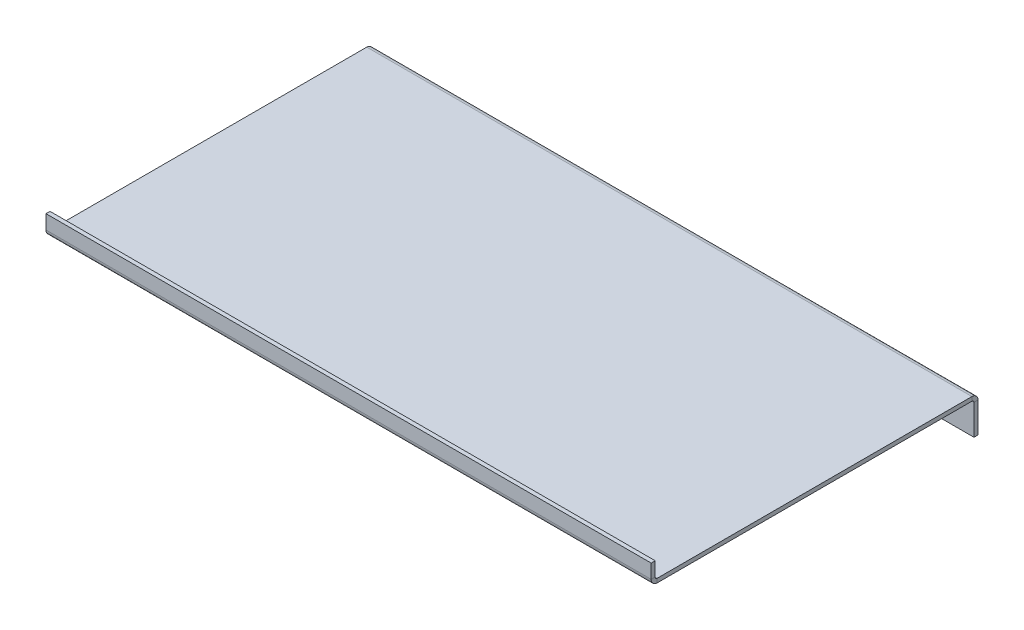
ISO-10303-21;
HEADER;
FILE_DESCRIPTION(('STEP AP214'),'2;1');
FILE_NAME('part.step','',(''),(''),'','','');
FILE_SCHEMA(('AUTOMOTIVE_DESIGN { 1 0 10303 214 1 1 1 1 }'));
ENDSEC;
DATA;
#1=APPLICATION_CONTEXT('core data for automotive mechanical design processes');
#2=APPLICATION_PROTOCOL_DEFINITION('international standard','automotive_design',2000,#1);
#3=PRODUCT_CONTEXT('',#1,'mechanical');
#4=PRODUCT('Part','Part','',(#3));
#5=PRODUCT_RELATED_PRODUCT_CATEGORY('part','',(#4));
#6=PRODUCT_DEFINITION_FORMATION('','',#4);
#7=PRODUCT_DEFINITION_CONTEXT('part definition',#1,'design');
#8=PRODUCT_DEFINITION('design','',#6,#7);
#9=PRODUCT_DEFINITION_SHAPE('','',#8);
#10=(LENGTH_UNIT() NAMED_UNIT(*) SI_UNIT(.MILLI.,.METRE.));
#11=(NAMED_UNIT(*) PLANE_ANGLE_UNIT() SI_UNIT($,.RADIAN.));
#12=(NAMED_UNIT(*) SI_UNIT($,.STERADIAN.) SOLID_ANGLE_UNIT());
#13=UNCERTAINTY_MEASURE_WITH_UNIT(LENGTH_MEASURE(1.E-05),#10,'distance_accuracy_value','');
#14=(GEOMETRIC_REPRESENTATION_CONTEXT(3) GLOBAL_UNCERTAINTY_ASSIGNED_CONTEXT((#13)) GLOBAL_UNIT_ASSIGNED_CONTEXT((#10,
#11,#12)) REPRESENTATION_CONTEXT('',''));
#15=CARTESIAN_POINT('',(0.,0.,0.));
#16=DIRECTION('',(0.,0.,1.));
#17=DIRECTION('',(1.,0.,0.));
#18=AXIS2_PLACEMENT_3D('',#15,#16,#17);
#19=CARTESIAN_POINT('',(150.,8.,0.5));
#20=DIRECTION('',(1.,0.,0.));
#21=DIRECTION('',(0.,0.,-1.));
#22=AXIS2_PLACEMENT_3D('',#19,#20,#21);
#23=PLANE('',#22);
#24=DIRECTION('',(0.,1.,0.));
#25=VECTOR('',#24,1.);
#26=CARTESIAN_POINT('',(150.,8.,0.5));
#27=LINE('',#26,#25);
#28=CARTESIAN_POINT('',(150.,8.,0.5));
#29=VERTEX_POINT('',#28);
#30=CARTESIAN_POINT('',(150.,9.,0.5));
#31=VERTEX_POINT('',#30);
#32=EDGE_CURVE('E11',#29,#31,#27,.T.);
#33=ORIENTED_EDGE('',*,*,#32,.F.);
#34=CARTESIAN_POINT('',(150.,7.5,0.5));
#35=DIRECTION('',(-1.,0.,0.));
#36=DIRECTION('',(0.,0.,1.));
#37=AXIS2_PLACEMENT_3D('',#34,#35,#36);
#38=CIRCLE('',#37,0.5);
#39=CARTESIAN_POINT('',(150.,7.5,0.));
#40=VERTEX_POINT('',#39);
#41=EDGE_CURVE('E245',#40,#29,#38,.F.);
#42=ORIENTED_EDGE('',*,*,#41,.F.);
#43=DIRECTION('',(0.,0.,1.));
#44=VECTOR('',#43,1.);
#45=CARTESIAN_POINT('',(150.,7.5,-1.));
#46=LINE('',#45,#44);
#47=CARTESIAN_POINT('',(150.,7.5,-1.));
#48=VERTEX_POINT('',#47);
#49=EDGE_CURVE('E43',#48,#40,#46,.T.);
#50=ORIENTED_EDGE('',*,*,#49,.F.);
#51=CARTESIAN_POINT('',(150.,7.5,0.5));
#52=DIRECTION('',(1.,0.,0.));
#53=DIRECTION('',(0.,0.,-1.));
#54=AXIS2_PLACEMENT_3D('',#51,#52,#53);
#55=CIRCLE('',#54,1.5);
#56=EDGE_CURVE('E144',#48,#31,#55,.T.);
#57=ORIENTED_EDGE('',*,*,#56,.T.);
#58=EDGE_LOOP('',(#33,#42,#50,#57));
#59=FACE_BOUND('',#58,.T.);
#60=ADVANCED_FACE('F35',(#59),#23,.T.);
#61=CARTESIAN_POINT('',(150.,7.5,-1.));
#62=DIRECTION('',(1.,0.,0.));
#63=DIRECTION('',(0.,0.,-1.));
#64=AXIS2_PLACEMENT_3D('',#61,#62,#63);
#65=PLANE('',#64);
#66=DIRECTION('',(0.,0.,1.));
#67=VECTOR('',#66,1.);
#68=CARTESIAN_POINT('',(150.,8.,0.));
#69=LINE('',#68,#67);
#70=CARTESIAN_POINT('',(150.,7.99999999999999,78.5));
#71=VERTEX_POINT('',#70);
#72=EDGE_CURVE('E138',#29,#71,#69,.T.);
#73=ORIENTED_EDGE('',*,*,#72,.F.);
#74=ORIENTED_EDGE('',*,*,#32,.T.);
#75=DIRECTION('',(0.,0.,1.));
#76=VECTOR('',#75,1.);
#77=CARTESIAN_POINT('',(150.,9.,0.));
#78=LINE('',#77,#76);
#79=CARTESIAN_POINT('',(150.,8.99999999999999,78.5));
#80=VERTEX_POINT('',#79);
#81=EDGE_CURVE('E135',#31,#80,#78,.T.);
#82=ORIENTED_EDGE('',*,*,#81,.T.);
#83=DIRECTION('',(0.,-1.,0.));
#84=VECTOR('',#83,1.);
#85=CARTESIAN_POINT('',(150.,8.99999999999999,78.5));
#86=LINE('',#85,#84);
#87=EDGE_CURVE('E226',#80,#71,#86,.T.);
#88=ORIENTED_EDGE('',*,*,#87,.T.);
#89=EDGE_LOOP('',(#73,#74,#82,#88));
#90=FACE_BOUND('',#89,.T.);
#91=ADVANCED_FACE('F133',(#90),#65,.T.);
#92=CARTESIAN_POINT('',(0.,7.5,0.));
#93=DIRECTION('',(-1.,0.,0.));
#94=DIRECTION('',(0.,0.,1.));
#95=AXIS2_PLACEMENT_3D('',#92,#93,#94);
#96=PLANE('',#95);
#97=DIRECTION('',(0.,0.,-1.));
#98=VECTOR('',#97,1.);
#99=CARTESIAN_POINT('',(0.,7.5,0.));
#100=LINE('',#99,#98);
#101=CARTESIAN_POINT('',(0.,7.5,0.));
#102=VERTEX_POINT('',#101);
#103=CARTESIAN_POINT('',(0.,7.5,-1.));
#104=VERTEX_POINT('',#103);
#105=EDGE_CURVE('E231',#102,#104,#100,.T.);
#106=ORIENTED_EDGE('',*,*,#105,.F.);
#107=CARTESIAN_POINT('',(0.,7.5,0.5));
#108=DIRECTION('',(-1.,0.,0.));
#109=DIRECTION('',(0.,0.,1.));
#110=AXIS2_PLACEMENT_3D('',#107,#108,#109);
#111=CIRCLE('',#110,0.5);
#112=CARTESIAN_POINT('',(0.,8.,0.5));
#113=VERTEX_POINT('',#112);
#114=EDGE_CURVE('E183',#102,#113,#111,.F.);
#115=ORIENTED_EDGE('',*,*,#114,.T.);
#116=DIRECTION('',(0.,-1.,0.));
#117=VECTOR('',#116,1.);
#118=CARTESIAN_POINT('',(0.,9.,0.5));
#119=LINE('',#118,#117);
#120=CARTESIAN_POINT('',(0.,9.,0.5));
#121=VERTEX_POINT('',#120);
#122=EDGE_CURVE('E229',#121,#113,#119,.T.);
#123=ORIENTED_EDGE('',*,*,#122,.F.);
#124=CARTESIAN_POINT('',(0.,7.5,0.5));
#125=DIRECTION('',(1.,0.,0.));
#126=DIRECTION('',(0.,0.,-1.));
#127=AXIS2_PLACEMENT_3D('',#124,#125,#126);
#128=CIRCLE('',#127,1.5);
#129=EDGE_CURVE('E156',#104,#121,#128,.T.);
#130=ORIENTED_EDGE('',*,*,#129,.F.);
#131=EDGE_LOOP('',(#106,#115,#123,#130));
#132=FACE_BOUND('',#131,.T.);
#133=ADVANCED_FACE('F283',(#132),#96,.T.);
#134=CARTESIAN_POINT('',(0.,9.,0.5));
#135=DIRECTION('',(-1.,0.,0.));
#136=DIRECTION('',(0.,0.,1.));
#137=AXIS2_PLACEMENT_3D('',#134,#135,#136);
#138=PLANE('',#137);
#139=DIRECTION('',(0.,1.,0.));
#140=VECTOR('',#139,1.);
#141=CARTESIAN_POINT('',(0.,0.,0.));
#142=LINE('',#141,#140);
#143=CARTESIAN_POINT('',(0.,0.,0.));
#144=VERTEX_POINT('',#143);
#145=EDGE_CURVE('E186',#144,#102,#142,.T.);
#146=ORIENTED_EDGE('',*,*,#145,.T.);
#147=ORIENTED_EDGE('',*,*,#105,.T.);
#148=DIRECTION('',(0.,1.,0.));
#149=VECTOR('',#148,1.);
#150=CARTESIAN_POINT('',(0.,0.,-1.));
#151=LINE('',#150,#149);
#152=CARTESIAN_POINT('',(0.,0.,-1.));
#153=VERTEX_POINT('',#152);
#154=EDGE_CURVE('E192',#153,#104,#151,.T.);
#155=ORIENTED_EDGE('',*,*,#154,.F.);
#156=DIRECTION('',(0.,0.,1.));
#157=VECTOR('',#156,1.);
#158=CARTESIAN_POINT('',(0.,0.,-1.));
#159=LINE('',#158,#157);
#160=EDGE_CURVE('E189',#153,#144,#159,.T.);
#161=ORIENTED_EDGE('',*,*,#160,.T.);
#162=EDGE_LOOP('',(#146,#147,#155,#161));
#163=FACE_BOUND('',#162,.T.);
#164=ADVANCED_FACE('F286',(#163),#138,.T.);
#165=CARTESIAN_POINT('',(150.,9.49999999999999,80.));
#166=DIRECTION('',(1.,0.,0.));
#167=DIRECTION('',(0.,0.,-1.));
#168=AXIS2_PLACEMENT_3D('',#165,#166,#167);
#169=PLANE('',#168);
#170=DIRECTION('',(0.,0.,-1.));
#171=VECTOR('',#170,1.);
#172=CARTESIAN_POINT('',(150.,9.49999999999999,80.));
#173=LINE('',#172,#171);
#174=CARTESIAN_POINT('',(150.,9.49999999999999,80.));
#175=VERTEX_POINT('',#174);
#176=CARTESIAN_POINT('',(150.,9.49999999999999,79.));
#177=VERTEX_POINT('',#176);
#178=EDGE_CURVE('E51',#175,#177,#173,.T.);
#179=ORIENTED_EDGE('',*,*,#178,.F.);
#180=CARTESIAN_POINT('',(150.,9.49999999999999,78.5));
#181=DIRECTION('',(1.,0.,0.));
#182=DIRECTION('',(0.,0.,-1.));
#183=AXIS2_PLACEMENT_3D('',#180,#181,#182);
#184=CIRCLE('',#183,1.5);
#185=EDGE_CURVE('E255',#71,#175,#184,.F.);
#186=ORIENTED_EDGE('',*,*,#185,.F.);
#187=ORIENTED_EDGE('',*,*,#87,.F.);
#188=CARTESIAN_POINT('',(150.,9.49999999999999,78.5));
#189=DIRECTION('',(1.,0.,0.));
#190=DIRECTION('',(0.,0.,-1.));
#191=AXIS2_PLACEMENT_3D('',#188,#189,#190);
#192=CIRCLE('',#191,0.5);
#193=EDGE_CURVE('E164',#80,#177,#192,.F.);
#194=ORIENTED_EDGE('',*,*,#193,.T.);
#195=EDGE_LOOP('',(#179,#186,#187,#194));
#196=FACE_BOUND('',#195,.T.);
#197=ADVANCED_FACE('F278',(#196),#169,.T.);
#198=CARTESIAN_POINT('',(150.,8.99999999999999,78.5));
#199=DIRECTION('',(1.,0.,0.));
#200=DIRECTION('',(0.,0.,-1.));
#201=AXIS2_PLACEMENT_3D('',#198,#199,#200);
#202=PLANE('',#201);
#203=DIRECTION('',(0.,1.,0.));
#204=VECTOR('',#203,1.);
#205=CARTESIAN_POINT('',(150.,7.99999999999999,80.));
#206=LINE('',#205,#204);
#207=CARTESIAN_POINT('',(150.,13.,80.));
#208=VERTEX_POINT('',#207);
#209=EDGE_CURVE('E258',#175,#208,#206,.T.);
#210=ORIENTED_EDGE('',*,*,#209,.F.);
#211=ORIENTED_EDGE('',*,*,#178,.T.);
#212=DIRECTION('',(0.,1.,0.));
#213=VECTOR('',#212,1.);
#214=CARTESIAN_POINT('',(150.,7.99999999999999,79.));
#215=LINE('',#214,#213);
#216=CARTESIAN_POINT('',(150.,13.,79.));
#217=VERTEX_POINT('',#216);
#218=EDGE_CURVE('E105',#177,#217,#215,.T.);
#219=ORIENTED_EDGE('',*,*,#218,.T.);
#220=DIRECTION('',(0.,0.,-1.));
#221=VECTOR('',#220,1.);
#222=CARTESIAN_POINT('',(150.,13.,80.));
#223=LINE('',#222,#221);
#224=EDGE_CURVE('E261',#208,#217,#223,.T.);
#225=ORIENTED_EDGE('',*,*,#224,.F.);
#226=EDGE_LOOP('',(#210,#211,#219,#225));
#227=FACE_BOUND('',#226,.T.);
#228=ADVANCED_FACE('F267',(#227),#202,.T.);
#229=CARTESIAN_POINT('',(0.,7.99999999999999,78.5));
#230=DIRECTION('',(-1.,0.,0.));
#231=DIRECTION('',(0.,0.,1.));
#232=AXIS2_PLACEMENT_3D('',#229,#230,#231);
#233=PLANE('',#232);
#234=DIRECTION('',(0.,1.,0.));
#235=VECTOR('',#234,1.);
#236=CARTESIAN_POINT('',(0.,7.99999999999999,78.5));
#237=LINE('',#236,#235);
#238=CARTESIAN_POINT('',(0.,7.99999999999999,78.5));
#239=VERTEX_POINT('',#238);
#240=CARTESIAN_POINT('',(0.,8.99999999999999,78.5));
#241=VERTEX_POINT('',#240);
#242=EDGE_CURVE('E92',#239,#241,#237,.T.);
#243=ORIENTED_EDGE('',*,*,#242,.F.);
#244=CARTESIAN_POINT('',(0.,9.49999999999999,78.5));
#245=DIRECTION('',(1.,0.,0.));
#246=DIRECTION('',(0.,0.,-1.));
#247=AXIS2_PLACEMENT_3D('',#244,#245,#246);
#248=CIRCLE('',#247,1.5);
#249=CARTESIAN_POINT('',(0.,9.49999999999999,80.));
#250=VERTEX_POINT('',#249);
#251=EDGE_CURVE('E179',#239,#250,#248,.F.);
#252=ORIENTED_EDGE('',*,*,#251,.T.);
#253=DIRECTION('',(0.,0.,1.));
#254=VECTOR('',#253,1.);
#255=CARTESIAN_POINT('',(0.,9.49999999999999,79.));
#256=LINE('',#255,#254);
#257=CARTESIAN_POINT('',(0.,9.49999999999999,79.));
#258=VERTEX_POINT('',#257);
#259=EDGE_CURVE('E99',#258,#250,#256,.T.);
#260=ORIENTED_EDGE('',*,*,#259,.F.);
#261=CARTESIAN_POINT('',(0.,9.49999999999999,78.5));
#262=DIRECTION('',(1.,0.,0.));
#263=DIRECTION('',(0.,0.,-1.));
#264=AXIS2_PLACEMENT_3D('',#261,#262,#263);
#265=CIRCLE('',#264,0.5);
#266=EDGE_CURVE('E198',#241,#258,#265,.F.);
#267=ORIENTED_EDGE('',*,*,#266,.F.);
#268=EDGE_LOOP('',(#243,#252,#260,#267));
#269=FACE_BOUND('',#268,.T.);
#270=ADVANCED_FACE('F315',(#269),#233,.T.);
#271=CARTESIAN_POINT('',(0.,9.49999999999999,79.));
#272=DIRECTION('',(-1.,0.,0.));
#273=DIRECTION('',(0.,0.,1.));
#274=AXIS2_PLACEMENT_3D('',#271,#272,#273);
#275=PLANE('',#274);
#276=DIRECTION('',(0.,0.,1.));
#277=VECTOR('',#276,1.);
#278=CARTESIAN_POINT('',(0.,8.,0.));
#279=LINE('',#278,#277);
#280=EDGE_CURVE('E181',#113,#239,#279,.T.);
#281=ORIENTED_EDGE('',*,*,#280,.T.);
#282=ORIENTED_EDGE('',*,*,#242,.T.);
#283=DIRECTION('',(0.,0.,1.));
#284=VECTOR('',#283,1.);
#285=CARTESIAN_POINT('',(0.,9.,0.));
#286=LINE('',#285,#284);
#287=EDGE_CURVE('E196',#121,#241,#286,.T.);
#288=ORIENTED_EDGE('',*,*,#287,.F.);
#289=ORIENTED_EDGE('',*,*,#122,.T.);
#290=EDGE_LOOP('',(#281,#282,#288,#289));
#291=FACE_BOUND('',#290,.T.);
#292=ADVANCED_FACE('F318',(#291),#275,.T.);
#293=CARTESIAN_POINT('',(150.,7.99999999999999,79.));
#294=DIRECTION('',(0.,0.,1.));
#295=DIRECTION('',(1.,0.,0.));
#296=AXIS2_PLACEMENT_3D('',#293,#294,#295);
#297=PLANE('',#296);
#298=DIRECTION('',(0.,1.,0.));
#299=VECTOR('',#298,1.);
#300=CARTESIAN_POINT('',(0.,7.99999999999999,79.));
#301=LINE('',#300,#299);
#302=CARTESIAN_POINT('',(0.,13.,79.));
#303=VERTEX_POINT('',#302);
#304=EDGE_CURVE('E170',#258,#303,#301,.T.);
#305=ORIENTED_EDGE('',*,*,#304,.T.);
#306=DIRECTION('',(-1.,0.,0.));
#307=VECTOR('',#306,1.);
#308=CARTESIAN_POINT('',(150.,13.,79.));
#309=LINE('',#308,#307);
#310=EDGE_CURVE('E222',#217,#303,#309,.T.);
#311=ORIENTED_EDGE('',*,*,#310,.F.);
#312=ORIENTED_EDGE('',*,*,#218,.F.);
#313=DIRECTION('',(-1.,0.,0.));
#314=VECTOR('',#313,1.);
#315=CARTESIAN_POINT('',(150.,9.49999999999999,79.));
#316=LINE('',#315,#314);
#317=EDGE_CURVE('E166',#177,#258,#316,.T.);
#318=ORIENTED_EDGE('',*,*,#317,.T.);
#319=EDGE_LOOP('',(#305,#311,#312,#318));
#320=FACE_BOUND('',#319,.T.);
#321=ADVANCED_FACE('F321',(#320),#297,.F.);
#322=CARTESIAN_POINT('',(150.,13.,80.));
#323=DIRECTION('',(0.,1.,0.));
#324=DIRECTION('',(0.,0.,1.));
#325=AXIS2_PLACEMENT_3D('',#322,#323,#324);
#326=PLANE('',#325);
#327=DIRECTION('',(0.,0.,-1.));
#328=VECTOR('',#327,1.);
#329=CARTESIAN_POINT('',(0.,13.,80.));
#330=LINE('',#329,#328);
#331=CARTESIAN_POINT('',(0.,13.,80.));
#332=VERTEX_POINT('',#331);
#333=EDGE_CURVE('E173',#332,#303,#330,.T.);
#334=ORIENTED_EDGE('',*,*,#333,.F.);
#335=DIRECTION('',(-1.,0.,0.));
#336=VECTOR('',#335,1.);
#337=CARTESIAN_POINT('',(150.,13.,80.));
#338=LINE('',#337,#336);
#339=EDGE_CURVE('E220',#208,#332,#338,.T.);
#340=ORIENTED_EDGE('',*,*,#339,.F.);
#341=ORIENTED_EDGE('',*,*,#224,.T.);
#342=ORIENTED_EDGE('',*,*,#310,.T.);
#343=EDGE_LOOP('',(#334,#340,#341,#342));
#344=FACE_BOUND('',#343,.T.);
#345=ADVANCED_FACE('F266',(#344),#326,.T.);
#346=CARTESIAN_POINT('',(150.,7.99999999999999,80.));
#347=DIRECTION('',(0.,0.,1.));
#348=DIRECTION('',(1.,0.,0.));
#349=AXIS2_PLACEMENT_3D('',#346,#347,#348);
#350=PLANE('',#349);
#351=DIRECTION('',(0.,1.,0.));
#352=VECTOR('',#351,1.);
#353=CARTESIAN_POINT('',(0.,7.99999999999999,80.));
#354=LINE('',#353,#352);
#355=EDGE_CURVE('E176',#250,#332,#354,.T.);
#356=ORIENTED_EDGE('',*,*,#355,.F.);
#357=DIRECTION('',(-1.,0.,0.));
#358=VECTOR('',#357,1.);
#359=CARTESIAN_POINT('',(150.,9.49999999999999,80.));
#360=LINE('',#359,#358);
#361=EDGE_CURVE('E217',#175,#250,#360,.T.);
#362=ORIENTED_EDGE('',*,*,#361,.F.);
#363=ORIENTED_EDGE('',*,*,#209,.T.);
#364=ORIENTED_EDGE('',*,*,#339,.T.);
#365=EDGE_LOOP('',(#356,#362,#363,#364));
#366=FACE_BOUND('',#365,.T.);
#367=ADVANCED_FACE('F271',(#366),#350,.T.);
#368=CARTESIAN_POINT('',(150.,9.49999999999999,78.5));
#369=DIRECTION('',(-1.,0.,0.));
#370=DIRECTION('',(0.,0.,1.));
#371=AXIS2_PLACEMENT_3D('',#368,#369,#370);
#372=CYLINDRICAL_SURFACE('',#371,1.5);
#373=ORIENTED_EDGE('',*,*,#251,.F.);
#374=DIRECTION('',(-1.,0.,0.));
#375=VECTOR('',#374,1.);
#376=CARTESIAN_POINT('',(150.,7.99999999999999,78.5));
#377=LINE('',#376,#375);
#378=EDGE_CURVE('E214',#71,#239,#377,.T.);
#379=ORIENTED_EDGE('',*,*,#378,.F.);
#380=ORIENTED_EDGE('',*,*,#185,.T.);
#381=ORIENTED_EDGE('',*,*,#361,.T.);
#382=EDGE_LOOP('',(#373,#379,#380,#381));
#383=FACE_BOUND('',#382,.T.);
#384=ADVANCED_FACE('F274',(#383),#372,.T.);
#385=CARTESIAN_POINT('',(150.,8.,0.));
#386=DIRECTION('',(0.,-1.,0.));
#387=DIRECTION('',(0.,0.,-1.));
#388=AXIS2_PLACEMENT_3D('',#385,#386,#387);
#389=PLANE('',#388);
#390=ORIENTED_EDGE('',*,*,#280,.F.);
#391=DIRECTION('',(-1.,0.,0.));
#392=VECTOR('',#391,1.);
#393=CARTESIAN_POINT('',(150.,8.,0.5));
#394=LINE('',#393,#392);
#395=EDGE_CURVE('E211',#29,#113,#394,.T.);
#396=ORIENTED_EDGE('',*,*,#395,.F.);
#397=ORIENTED_EDGE('',*,*,#72,.T.);
#398=ORIENTED_EDGE('',*,*,#378,.T.);
#399=EDGE_LOOP('',(#390,#396,#397,#398));
#400=FACE_BOUND('',#399,.T.);
#401=ADVANCED_FACE('F281',(#400),#389,.T.);
#402=CARTESIAN_POINT('',(150.,7.5,0.5));
#403=DIRECTION('',(-1.,0.,0.));
#404=DIRECTION('',(0.,0.,1.));
#405=AXIS2_PLACEMENT_3D('',#402,#403,#404);
#406=CYLINDRICAL_SURFACE('',#405,0.5);
#407=ORIENTED_EDGE('',*,*,#114,.F.);
#408=DIRECTION('',(-1.,0.,0.));
#409=VECTOR('',#408,1.);
#410=CARTESIAN_POINT('',(150.,7.5,0.));
#411=LINE('',#410,#409);
#412=EDGE_CURVE('E208',#40,#102,#411,.T.);
#413=ORIENTED_EDGE('',*,*,#412,.F.);
#414=ORIENTED_EDGE('',*,*,#41,.T.);
#415=ORIENTED_EDGE('',*,*,#395,.T.);
#416=EDGE_LOOP('',(#407,#413,#414,#415));
#417=FACE_BOUND('',#416,.T.);
#418=ADVANCED_FACE('F244',(#417),#406,.F.);
#419=CARTESIAN_POINT('',(150.,0.,0.));
#420=DIRECTION('',(0.,0.,1.));
#421=DIRECTION('',(1.,0.,0.));
#422=AXIS2_PLACEMENT_3D('',#419,#420,#421);
#423=PLANE('',#422);
#424=ORIENTED_EDGE('',*,*,#145,.F.);
#425=DIRECTION('',(-1.,0.,0.));
#426=VECTOR('',#425,1.);
#427=CARTESIAN_POINT('',(150.,0.,0.));
#428=LINE('',#427,#426);
#429=CARTESIAN_POINT('',(150.,0.,0.));
#430=VERTEX_POINT('',#429);
#431=EDGE_CURVE('E206',#430,#144,#428,.T.);
#432=ORIENTED_EDGE('',*,*,#431,.F.);
#433=DIRECTION('',(0.,1.,0.));
#434=VECTOR('',#433,1.);
#435=CARTESIAN_POINT('',(150.,0.,0.));
#436=LINE('',#435,#434);
#437=EDGE_CURVE('E238',#430,#40,#436,.T.);
#438=ORIENTED_EDGE('',*,*,#437,.T.);
#439=ORIENTED_EDGE('',*,*,#412,.T.);
#440=EDGE_LOOP('',(#424,#432,#438,#439));
#441=FACE_BOUND('',#440,.T.);
#442=ADVANCED_FACE('F249',(#441),#423,.T.);
#443=CARTESIAN_POINT('',(150.,0.,-1.));
#444=DIRECTION('',(0.,-1.,0.));
#445=DIRECTION('',(0.,0.,-1.));
#446=AXIS2_PLACEMENT_3D('',#443,#444,#445);
#447=PLANE('',#446);
#448=ORIENTED_EDGE('',*,*,#160,.F.);
#449=DIRECTION('',(-1.,0.,0.));
#450=VECTOR('',#449,1.);
#451=CARTESIAN_POINT('',(150.,0.,-1.));
#452=LINE('',#451,#450);
#453=CARTESIAN_POINT('',(150.,0.,-1.));
#454=VERTEX_POINT('',#453);
#455=EDGE_CURVE('E204',#454,#153,#452,.T.);
#456=ORIENTED_EDGE('',*,*,#455,.F.);
#457=DIRECTION('',(0.,0.,1.));
#458=VECTOR('',#457,1.);
#459=CARTESIAN_POINT('',(150.,0.,-1.));
#460=LINE('',#459,#458);
#461=EDGE_CURVE('E250',#454,#430,#460,.T.);
#462=ORIENTED_EDGE('',*,*,#461,.T.);
#463=ORIENTED_EDGE('',*,*,#431,.T.);
#464=EDGE_LOOP('',(#448,#456,#462,#463));
#465=FACE_BOUND('',#464,.T.);
#466=ADVANCED_FACE('F291',(#465),#447,.T.);
#467=CARTESIAN_POINT('',(150.,0.,-1.));
#468=DIRECTION('',(0.,0.,1.));
#469=DIRECTION('',(1.,0.,0.));
#470=AXIS2_PLACEMENT_3D('',#467,#468,#469);
#471=PLANE('',#470);
#472=ORIENTED_EDGE('',*,*,#154,.T.);
#473=DIRECTION('',(-1.,0.,0.));
#474=VECTOR('',#473,1.);
#475=CARTESIAN_POINT('',(150.,7.5,-1.));
#476=LINE('',#475,#474);
#477=EDGE_CURVE('E158',#48,#104,#476,.T.);
#478=ORIENTED_EDGE('',*,*,#477,.F.);
#479=DIRECTION('',(0.,1.,0.));
#480=VECTOR('',#479,1.);
#481=CARTESIAN_POINT('',(150.,0.,-1.));
#482=LINE('',#481,#480);
#483=EDGE_CURVE('E149',#454,#48,#482,.T.);
#484=ORIENTED_EDGE('',*,*,#483,.F.);
#485=ORIENTED_EDGE('',*,*,#455,.T.);
#486=EDGE_LOOP('',(#472,#478,#484,#485));
#487=FACE_BOUND('',#486,.T.);
#488=ADVANCED_FACE('F289',(#487),#471,.F.);
#489=CARTESIAN_POINT('',(150.,7.5,0.5));
#490=DIRECTION('',(-1.,0.,0.));
#491=DIRECTION('',(0.,0.,1.));
#492=AXIS2_PLACEMENT_3D('',#489,#490,#491);
#493=CYLINDRICAL_SURFACE('',#492,1.5);
#494=ORIENTED_EDGE('',*,*,#129,.T.);
#495=DIRECTION('',(-1.,0.,0.));
#496=VECTOR('',#495,1.);
#497=CARTESIAN_POINT('',(150.,9.,0.5));
#498=LINE('',#497,#496);
#499=EDGE_CURVE('E153',#31,#121,#498,.T.);
#500=ORIENTED_EDGE('',*,*,#499,.F.);
#501=ORIENTED_EDGE('',*,*,#56,.F.);
#502=ORIENTED_EDGE('',*,*,#477,.T.);
#503=EDGE_LOOP('',(#494,#500,#501,#502));
#504=FACE_BOUND('',#503,.T.);
#505=ADVANCED_FACE('F154',(#504),#493,.T.);
#506=CARTESIAN_POINT('',(150.,9.,0.));
#507=DIRECTION('',(0.,-1.,0.));
#508=DIRECTION('',(0.,0.,-1.));
#509=AXIS2_PLACEMENT_3D('',#506,#507,#508);
#510=PLANE('',#509);
#511=ORIENTED_EDGE('',*,*,#287,.T.);
#512=DIRECTION('',(-1.,0.,0.));
#513=VECTOR('',#512,1.);
#514=CARTESIAN_POINT('',(150.,8.99999999999999,78.5));
#515=LINE('',#514,#513);
#516=EDGE_CURVE('E159',#80,#241,#515,.T.);
#517=ORIENTED_EDGE('',*,*,#516,.F.);
#518=ORIENTED_EDGE('',*,*,#81,.F.);
#519=ORIENTED_EDGE('',*,*,#499,.T.);
#520=EDGE_LOOP('',(#511,#517,#518,#519));
#521=FACE_BOUND('',#520,.T.);
#522=ADVANCED_FACE('F161',(#521),#510,.F.);
#523=CARTESIAN_POINT('',(150.,9.49999999999999,78.5));
#524=DIRECTION('',(-1.,0.,0.));
#525=DIRECTION('',(0.,0.,1.));
#526=AXIS2_PLACEMENT_3D('',#523,#524,#525);
#527=CYLINDRICAL_SURFACE('',#526,0.5);
#528=ORIENTED_EDGE('',*,*,#266,.T.);
#529=ORIENTED_EDGE('',*,*,#317,.F.);
#530=ORIENTED_EDGE('',*,*,#193,.F.);
#531=ORIENTED_EDGE('',*,*,#516,.T.);
#532=EDGE_LOOP('',(#528,#529,#530,#531));
#533=FACE_BOUND('',#532,.T.);
#534=ADVANCED_FACE('F373',(#533),#527,.F.);
#535=CARTESIAN_POINT('',(150.,9.49999999999999,78.5));
#536=DIRECTION('',(1.,0.,0.));
#537=DIRECTION('',(0.,0.,-1.));
#538=AXIS2_PLACEMENT_3D('',#535,#536,#537);
#539=PLANE('',#538);
#540=ORIENTED_EDGE('',*,*,#483,.T.);
#541=ORIENTED_EDGE('',*,*,#49,.T.);
#542=ORIENTED_EDGE('',*,*,#437,.F.);
#543=ORIENTED_EDGE('',*,*,#461,.F.);
#544=EDGE_LOOP('',(#540,#541,#542,#543));
#545=FACE_BOUND('',#544,.T.);
#546=ADVANCED_FACE('F235',(#545),#539,.T.);
#547=CARTESIAN_POINT('',(0.,9.49999999999999,78.5));
#548=DIRECTION('',(1.,0.,0.));
#549=DIRECTION('',(0.,0.,-1.));
#550=AXIS2_PLACEMENT_3D('',#547,#548,#549);
#551=PLANE('',#550);
#552=ORIENTED_EDGE('',*,*,#304,.F.);
#553=ORIENTED_EDGE('',*,*,#259,.T.);
#554=ORIENTED_EDGE('',*,*,#355,.T.);
#555=ORIENTED_EDGE('',*,*,#333,.T.);
#556=EDGE_LOOP('',(#552,#553,#554,#555));
#557=FACE_BOUND('',#556,.T.);
#558=ADVANCED_FACE('F393',(#557),#551,.F.);
#559=CLOSED_SHELL('',(#60,#91,#133,#164,#197,#228,#270,#292,#321,#345,#367,#384,#401,#418,#442,
#466,#488,#505,#522,#534,#546,#558));
#560=MANIFOLD_SOLID_BREP('B2',#559);
#561=ADVANCED_BREP_SHAPE_REPRESENTATION('',(#18,#560),#14);
#562=SHAPE_DEFINITION_REPRESENTATION(#9,#561);
ENDSEC;
END-ISO-10303-21;
